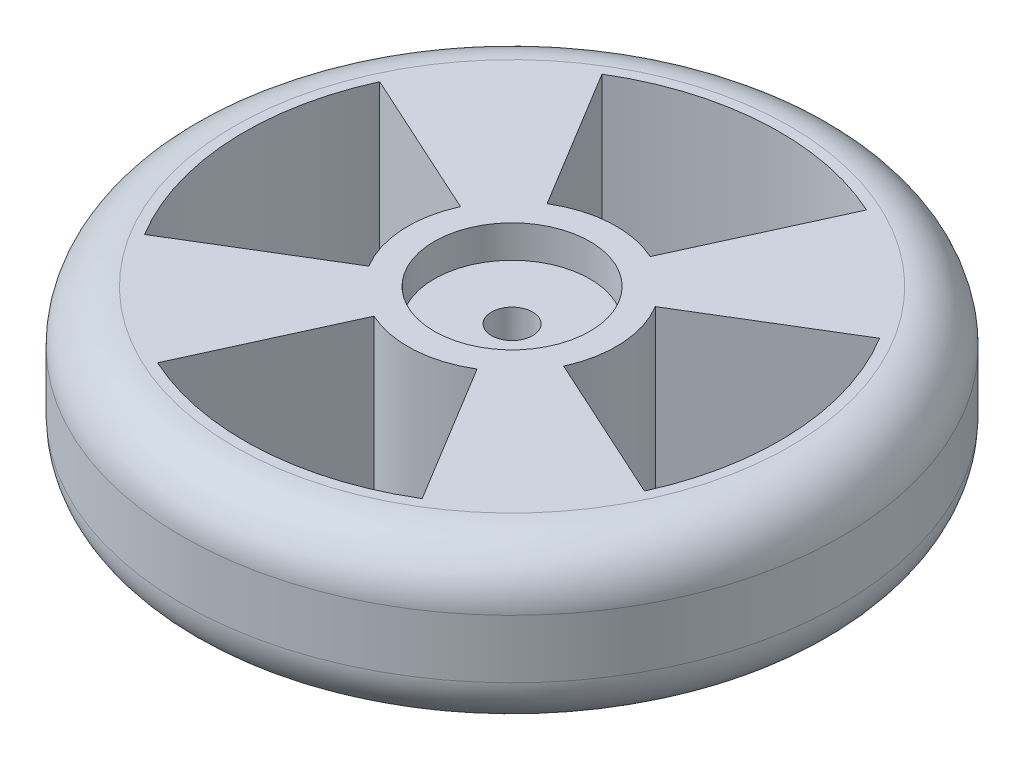
ISO-10303-21;
HEADER;
FILE_DESCRIPTION(('STEP AP214'),'2;1');
FILE_NAME('part.step','',(''),(''),'','','');
FILE_SCHEMA(('AUTOMOTIVE_DESIGN { 1 0 10303 214 1 1 1 1 }'));
ENDSEC;
DATA;
#1=APPLICATION_CONTEXT('core data for automotive mechanical design processes');
#2=APPLICATION_PROTOCOL_DEFINITION('international standard','automotive_design',2000,#1);
#3=PRODUCT_CONTEXT('',#1,'mechanical');
#4=PRODUCT('Part','Part','',(#3));
#5=PRODUCT_RELATED_PRODUCT_CATEGORY('part','',(#4));
#6=PRODUCT_DEFINITION_FORMATION('','',#4);
#7=PRODUCT_DEFINITION_CONTEXT('part definition',#1,'design');
#8=PRODUCT_DEFINITION('design','',#6,#7);
#9=PRODUCT_DEFINITION_SHAPE('','',#8);
#10=(LENGTH_UNIT() NAMED_UNIT(*) SI_UNIT(.MILLI.,.METRE.));
#11=(NAMED_UNIT(*) PLANE_ANGLE_UNIT() SI_UNIT($,.RADIAN.));
#12=(NAMED_UNIT(*) SI_UNIT($,.STERADIAN.) SOLID_ANGLE_UNIT());
#13=UNCERTAINTY_MEASURE_WITH_UNIT(LENGTH_MEASURE(1.E-05),#10,'distance_accuracy_value','');
#14=(GEOMETRIC_REPRESENTATION_CONTEXT(3) GLOBAL_UNCERTAINTY_ASSIGNED_CONTEXT((#13)) GLOBAL_UNIT_ASSIGNED_CONTEXT((#10,
#11,#12)) REPRESENTATION_CONTEXT('',''));
#15=CARTESIAN_POINT('',(0.,0.,0.));
#16=DIRECTION('',(0.,0.,1.));
#17=DIRECTION('',(1.,0.,0.));
#18=AXIS2_PLACEMENT_3D('',#15,#16,#17);
#19=CARTESIAN_POINT('',(0.,25.,0.));
#20=DIRECTION('',(0.,-1.,0.));
#21=DIRECTION('',(0.,0.,-1.));
#22=AXIS2_PLACEMENT_3D('',#19,#20,#21);
#23=CYLINDRICAL_SURFACE('',#22,50.8);
#24=CARTESIAN_POINT('',(0.,8.,0.));
#25=DIRECTION('',(0.,1.,0.));
#26=DIRECTION('',(0.,0.,1.));
#27=AXIS2_PLACEMENT_3D('',#24,#25,#26);
#28=CIRCLE('',#27,50.8);
#29=CARTESIAN_POINT('',(0.,8.,50.8));
#30=VERTEX_POINT('',#29);
#31=EDGE_CURVE('E357',#30,#30,#28,.T.);
#32=ORIENTED_EDGE('',*,*,#31,.T.);
#33=EDGE_LOOP('',(#32));
#34=FACE_BOUND('',#33,.T.);
#35=CARTESIAN_POINT('',(0.,17.,0.));
#36=DIRECTION('',(0.,1.,0.));
#37=DIRECTION('',(0.,0.,1.));
#38=AXIS2_PLACEMENT_3D('',#35,#36,#37);
#39=CIRCLE('',#38,50.8);
#40=CARTESIAN_POINT('',(0.,17.,50.8));
#41=VERTEX_POINT('',#40);
#42=EDGE_CURVE('E353',#41,#41,#39,.F.);
#43=ORIENTED_EDGE('',*,*,#42,.T.);
#44=EDGE_LOOP('',(#43));
#45=FACE_BOUND('',#44,.T.);
#46=ADVANCED_FACE('F39',(#34,#45),#23,.T.);
#47=CARTESIAN_POINT('',(0.,25.,0.));
#48=DIRECTION('',(0.,1.,0.));
#49=DIRECTION('',(0.,0.,1.));
#50=AXIS2_PLACEMENT_3D('',#47,#48,#49);
#51=PLANE('',#50);
#52=CARTESIAN_POINT('',(0.,25.,0.));
#53=DIRECTION('',(0.,-1.,0.));
#54=DIRECTION('',(0.,0.,1.));
#55=AXIS2_PLACEMENT_3D('',#52,#53,#54);
#56=CIRCLE('',#55,16.0687261905688);
#57=CARTESIAN_POINT('',(8.33744290540899,25.,13.7364845279466));
#58=VERTEX_POINT('',#57);
#59=CARTESIAN_POINT('',(-6.66964014308334,25.,14.6191607744509));
#60=VERTEX_POINT('',#59);
#61=EDGE_CURVE('E55',#58,#60,#56,.T.);
#62=ORIENTED_EDGE('',*,*,#61,.F.);
#63=DIRECTION('',(-0.518861470817922,0.,-0.854858335691162));
#64=VECTOR('',#63,1.);
#65=CARTESIAN_POINT('',(8.33744290540899,25.,13.7364845279466));
#66=LINE('',#65,#64);
#67=CARTESIAN_POINT('',(21.4007271001007,25.,35.2591028247552));
#68=VERTEX_POINT('',#67);
#69=EDGE_CURVE('E231',#68,#58,#66,.T.);
#70=ORIENTED_EDGE('',*,*,#69,.F.);
#71=CARTESIAN_POINT('',(0.,25.,0.));
#72=DIRECTION('',(0.,1.,0.));
#73=DIRECTION('',(0.,0.,1.));
#74=AXIS2_PLACEMENT_3D('',#71,#72,#73);
#75=CIRCLE('',#74,41.245550698465);
#76=CARTESIAN_POINT('',(-17.1197752329317,25.,37.5247751278211));
#77=VERTEX_POINT('',#76);
#78=EDGE_CURVE('E227',#77,#68,#75,.T.);
#79=ORIENTED_EDGE('',*,*,#78,.F.);
#80=DIRECTION('',(-0.415069624311474,0.,0.90978964984986));
#81=VECTOR('',#80,1.);
#82=CARTESIAN_POINT('',(-6.66964014308333,25.,14.6191607744509));
#83=LINE('',#82,#81);
#84=EDGE_CURVE('E223',#60,#77,#83,.T.);
#85=ORIENTED_EDGE('',*,*,#84,.F.);
#86=EDGE_LOOP('',(#62,#70,#79,#85));
#87=FACE_BOUND('',#86,.T.);
#88=CARTESIAN_POINT('',(0.,25.,0.));
#89=DIRECTION('',(0.,-1.,0.));
#90=DIRECTION('',(0.,0.,1.));
#91=AXIS2_PLACEMENT_3D('',#88,#89,#90);
#92=CIRCLE('',#91,16.0687261905688);
#93=CARTESIAN_POINT('',(13.7364845279466,25.,-8.33744290540903));
#94=VERTEX_POINT('',#93);
#95=CARTESIAN_POINT('',(14.6191607744509,25.,6.66964014308329));
#96=VERTEX_POINT('',#95);
#97=EDGE_CURVE('E63',#94,#96,#92,.T.);
#98=ORIENTED_EDGE('',*,*,#97,.F.);
#99=DIRECTION('',(-0.85485833569116,0.,0.518861470817925));
#100=VECTOR('',#99,1.);
#101=CARTESIAN_POINT('',(13.7364845279466,25.,-8.33744290540903));
#102=LINE('',#101,#100);
#103=CARTESIAN_POINT('',(35.2591028247551,25.,-21.4007271001008));
#104=VERTEX_POINT('',#103);
#105=EDGE_CURVE('E257',#104,#94,#102,.T.);
#106=ORIENTED_EDGE('',*,*,#105,.F.);
#107=CARTESIAN_POINT('',(0.,25.,0.));
#108=DIRECTION('',(0.,1.,0.));
#109=DIRECTION('',(0.,0.,1.));
#110=AXIS2_PLACEMENT_3D('',#107,#108,#109);
#111=CIRCLE('',#110,41.245550698465);
#112=CARTESIAN_POINT('',(37.5247751278212,25.,17.1197752329316));
#113=VERTEX_POINT('',#112);
#114=EDGE_CURVE('E253',#113,#104,#111,.T.);
#115=ORIENTED_EDGE('',*,*,#114,.F.);
#116=DIRECTION('',(0.909789649849862,0.,0.415069624311471));
#117=VECTOR('',#116,1.);
#118=CARTESIAN_POINT('',(14.6191607744509,25.,6.66964014308329));
#119=LINE('',#118,#117);
#120=EDGE_CURVE('E249',#96,#113,#119,.T.);
#121=ORIENTED_EDGE('',*,*,#120,.F.);
#122=EDGE_LOOP('',(#98,#106,#115,#121));
#123=FACE_BOUND('',#122,.T.);
#124=CARTESIAN_POINT('',(0.,25.,0.));
#125=DIRECTION('',(0.,-1.,0.));
#126=DIRECTION('',(0.,0.,1.));
#127=AXIS2_PLACEMENT_3D('',#124,#125,#126);
#128=CIRCLE('',#127,16.0687261905688);
#129=CARTESIAN_POINT('',(-13.7364845279467,25.,8.33744290540894));
#130=VERTEX_POINT('',#129);
#131=CARTESIAN_POINT('',(-14.6191607744508,25.,-6.66964014308339));
#132=VERTEX_POINT('',#131);
#133=EDGE_CURVE('E202',#130,#132,#128,.T.);
#134=ORIENTED_EDGE('',*,*,#133,.F.);
#135=DIRECTION('',(0.854858335691163,0.,-0.518861470817919));
#136=VECTOR('',#135,1.);
#137=CARTESIAN_POINT('',(-13.7364845279467,25.,8.33744290540894));
#138=LINE('',#137,#136);
#139=CARTESIAN_POINT('',(-35.2591028247553,25.,21.4007271001006));
#140=VERTEX_POINT('',#139);
#141=EDGE_CURVE('E207',#140,#130,#138,.T.);
#142=ORIENTED_EDGE('',*,*,#141,.F.);
#143=CARTESIAN_POINT('',(0.,25.,0.));
#144=DIRECTION('',(0.,1.,0.));
#145=DIRECTION('',(0.,0.,1.));
#146=AXIS2_PLACEMENT_3D('',#143,#144,#145);
#147=CIRCLE('',#146,41.245550698465);
#148=CARTESIAN_POINT('',(-37.5247751278211,25.,-17.1197752329319));
#149=VERTEX_POINT('',#148);
#150=EDGE_CURVE('E184',#149,#140,#147,.T.);
#151=ORIENTED_EDGE('',*,*,#150,.F.);
#152=DIRECTION('',(-0.909789649849859,0.,-0.415069624311477));
#153=VECTOR('',#152,1.);
#154=CARTESIAN_POINT('',(-14.6191607744508,25.,-6.66964014308339));
#155=LINE('',#154,#153);
#156=EDGE_CURVE('E196',#132,#149,#155,.T.);
#157=ORIENTED_EDGE('',*,*,#156,.F.);
#158=EDGE_LOOP('',(#134,#142,#151,#157));
#159=FACE_BOUND('',#158,.T.);
#160=CARTESIAN_POINT('',(0.,25.,0.));
#161=DIRECTION('',(0.,-1.,0.));
#162=DIRECTION('',(0.,0.,1.));
#163=AXIS2_PLACEMENT_3D('',#160,#161,#162);
#164=CIRCLE('',#163,16.0687261905688);
#165=CARTESIAN_POINT('',(-8.33744290540909,25.,-13.7364845279466));
#166=VERTEX_POINT('',#165);
#167=CARTESIAN_POINT('',(6.66964014308323,25.,-14.6191607744509));
#168=VERTEX_POINT('',#167);
#169=EDGE_CURVE('E265',#166,#168,#164,.T.);
#170=ORIENTED_EDGE('',*,*,#169,.F.);
#171=DIRECTION('',(0.518861470817928,0.,0.854858335691158));
#172=VECTOR('',#171,1.);
#173=CARTESIAN_POINT('',(-8.33744290540909,25.,-13.7364845279466));
#174=LINE('',#173,#172);
#175=CARTESIAN_POINT('',(-21.4007271001009,25.,-35.259102824755));
#176=VERTEX_POINT('',#175);
#177=EDGE_CURVE('E284',#176,#166,#174,.T.);
#178=ORIENTED_EDGE('',*,*,#177,.F.);
#179=CARTESIAN_POINT('',(0.,25.,0.));
#180=DIRECTION('',(0.,1.,0.));
#181=DIRECTION('',(0.,0.,1.));
#182=AXIS2_PLACEMENT_3D('',#179,#180,#181);
#183=CIRCLE('',#182,41.245550698465);
#184=CARTESIAN_POINT('',(17.1197752329315,25.,-37.5247751278212));
#185=VERTEX_POINT('',#184);
#186=EDGE_CURVE('E280',#185,#176,#183,.T.);
#187=ORIENTED_EDGE('',*,*,#186,.F.);
#188=DIRECTION('',(0.415069624311468,0.,-0.909789649849864));
#189=VECTOR('',#188,1.);
#190=CARTESIAN_POINT('',(6.66964014308324,25.,-14.6191607744509));
#191=LINE('',#190,#189);
#192=EDGE_CURVE('E276',#168,#185,#191,.T.);
#193=ORIENTED_EDGE('',*,*,#192,.F.);
#194=EDGE_LOOP('',(#170,#178,#187,#193));
#195=FACE_BOUND('',#194,.T.);
#196=CARTESIAN_POINT('',(0.,25.,0.));
#197=DIRECTION('',(0.,1.,0.));
#198=DIRECTION('',(0.,0.,1.));
#199=AXIS2_PLACEMENT_3D('',#196,#197,#198);
#200=CIRCLE('',#199,12.);
#201=CARTESIAN_POINT('',(0.,25.,12.));
#202=VERTEX_POINT('',#201);
#203=EDGE_CURVE('E342',#202,#202,#200,.T.);
#204=ORIENTED_EDGE('',*,*,#203,.F.);
#205=EDGE_LOOP('',(#204));
#206=FACE_BOUND('',#205,.T.);
#207=CARTESIAN_POINT('',(0.,25.,0.));
#208=DIRECTION('',(0.,1.,0.));
#209=DIRECTION('',(0.,0.,1.));
#210=AXIS2_PLACEMENT_3D('',#207,#208,#209);
#211=CIRCLE('',#210,42.8);
#212=CARTESIAN_POINT('',(0.,25.,42.8));
#213=VERTEX_POINT('',#212);
#214=EDGE_CURVE('E349',#213,#213,#211,.T.);
#215=ORIENTED_EDGE('',*,*,#214,.T.);
#216=EDGE_LOOP('',(#215));
#217=FACE_BOUND('',#216,.T.);
#218=ADVANCED_FACE('F204',(#87,#123,#159,#195,#206,#217),#51,.T.);
#219=CARTESIAN_POINT('',(0.,0.,0.));
#220=DIRECTION('',(0.,1.,0.));
#221=DIRECTION('',(0.,0.,1.));
#222=AXIS2_PLACEMENT_3D('',#219,#220,#221);
#223=PLANE('',#222);
#224=CARTESIAN_POINT('',(0.,0.,0.));
#225=DIRECTION('',(0.,1.,0.));
#226=DIRECTION('',(0.,0.,1.));
#227=AXIS2_PLACEMENT_3D('',#224,#225,#226);
#228=CIRCLE('',#227,41.245550698465);
#229=CARTESIAN_POINT('',(-17.1197752329317,0.,37.5247751278211));
#230=VERTEX_POINT('',#229);
#231=CARTESIAN_POINT('',(21.4007271001007,0.,35.2591028247552));
#232=VERTEX_POINT('',#231);
#233=EDGE_CURVE('E11',#230,#232,#228,.T.);
#234=ORIENTED_EDGE('',*,*,#233,.T.);
#235=DIRECTION('',(-0.518861470817922,0.,-0.854858335691162));
#236=VECTOR('',#235,1.);
#237=CARTESIAN_POINT('',(0.,0.,0.));
#238=LINE('',#237,#236);
#239=CARTESIAN_POINT('',(11.6309017171609,0.,19.1626741312013));
#240=VERTEX_POINT('',#239);
#241=EDGE_CURVE('E328',#232,#240,#238,.T.);
#242=ORIENTED_EDGE('',*,*,#241,.T.);
#243=CARTESIAN_POINT('',(0.,0.,0.));
#244=DIRECTION('',(0.,1.,0.));
#245=DIRECTION('',(0.,0.,1.));
#246=AXIS2_PLACEMENT_3D('',#243,#244,#245);
#247=CIRCLE('',#246,22.4161984870957);
#248=CARTESIAN_POINT('',(20.3940253725398,0.,9.30428308453016));
#249=VERTEX_POINT('',#248);
#250=EDGE_CURVE('E366',#240,#249,#247,.T.);
#251=ORIENTED_EDGE('',*,*,#250,.T.);
#252=DIRECTION('',(0.909789649849862,0.,0.415069624311471));
#253=VECTOR('',#252,1.);
#254=CARTESIAN_POINT('',(0.,0.,0.));
#255=LINE('',#254,#253);
#256=CARTESIAN_POINT('',(37.5247751278212,0.,17.1197752329316));
#257=VERTEX_POINT('',#256);
#258=EDGE_CURVE('E316',#249,#257,#255,.T.);
#259=ORIENTED_EDGE('',*,*,#258,.T.);
#260=CARTESIAN_POINT('',(0.,0.,0.));
#261=DIRECTION('',(0.,1.,0.));
#262=DIRECTION('',(0.,0.,1.));
#263=AXIS2_PLACEMENT_3D('',#260,#261,#262);
#264=CIRCLE('',#263,41.245550698465);
#265=CARTESIAN_POINT('',(35.2591028247551,0.,-21.4007271001008));
#266=VERTEX_POINT('',#265);
#267=EDGE_CURVE('E48',#257,#266,#264,.T.);
#268=ORIENTED_EDGE('',*,*,#267,.T.);
#269=DIRECTION('',(-0.85485833569116,0.,0.518861470817925));
#270=VECTOR('',#269,1.);
#271=CARTESIAN_POINT('',(0.,0.,0.));
#272=LINE('',#271,#270);
#273=CARTESIAN_POINT('',(19.1626741312013,0.,-11.630901717161));
#274=VERTEX_POINT('',#273);
#275=EDGE_CURVE('E320',#266,#274,#272,.T.);
#276=ORIENTED_EDGE('',*,*,#275,.T.);
#277=CARTESIAN_POINT('',(9.30428308453009,0.,-20.3940253725398));
#278=VERTEX_POINT('',#277);
#279=EDGE_CURVE('E371',#274,#278,#247,.T.);
#280=ORIENTED_EDGE('',*,*,#279,.T.);
#281=DIRECTION('',(0.415069624311468,0.,-0.909789649849863));
#282=VECTOR('',#281,1.);
#283=CARTESIAN_POINT('',(0.,0.,0.));
#284=LINE('',#283,#282);
#285=CARTESIAN_POINT('',(17.1197752329315,0.,-37.5247751278212));
#286=VERTEX_POINT('',#285);
#287=EDGE_CURVE('E292',#278,#286,#284,.T.);
#288=ORIENTED_EDGE('',*,*,#287,.T.);
#289=CARTESIAN_POINT('',(0.,0.,0.));
#290=DIRECTION('',(0.,1.,0.));
#291=DIRECTION('',(0.,0.,1.));
#292=AXIS2_PLACEMENT_3D('',#289,#290,#291);
#293=CIRCLE('',#292,41.245550698465);
#294=CARTESIAN_POINT('',(-21.4007271001009,0.,-35.259102824755));
#295=VERTEX_POINT('',#294);
#296=EDGE_CURVE('E422',#286,#295,#293,.T.);
#297=ORIENTED_EDGE('',*,*,#296,.T.);
#298=DIRECTION('',(0.518861470817928,0.,0.854858335691158));
#299=VECTOR('',#298,1.);
#300=CARTESIAN_POINT('',(0.,0.,0.));
#301=LINE('',#300,#299);
#302=CARTESIAN_POINT('',(-11.6309017171611,0.,-19.1626741312012));
#303=VERTEX_POINT('',#302);
#304=EDGE_CURVE('E305',#295,#303,#301,.T.);
#305=ORIENTED_EDGE('',*,*,#304,.T.);
#306=CARTESIAN_POINT('',(-20.3940253725397,0.,-9.3042830845303));
#307=VERTEX_POINT('',#306);
#308=EDGE_CURVE('E451',#303,#307,#247,.T.);
#309=ORIENTED_EDGE('',*,*,#308,.T.);
#310=DIRECTION('',(-0.909789649849859,0.,-0.415069624311477));
#311=VECTOR('',#310,1.);
#312=CARTESIAN_POINT('',(0.,0.,0.));
#313=LINE('',#312,#311);
#314=CARTESIAN_POINT('',(-37.5247751278211,0.,-17.1197752329319));
#315=VERTEX_POINT('',#314);
#316=EDGE_CURVE('E309',#307,#315,#313,.T.);
#317=ORIENTED_EDGE('',*,*,#316,.T.);
#318=CARTESIAN_POINT('',(0.,0.,0.));
#319=DIRECTION('',(0.,1.,0.));
#320=DIRECTION('',(0.,0.,1.));
#321=AXIS2_PLACEMENT_3D('',#318,#319,#320);
#322=CIRCLE('',#321,41.245550698465);
#323=CARTESIAN_POINT('',(-35.2591028247553,0.,21.4007271001006));
#324=VERTEX_POINT('',#323);
#325=EDGE_CURVE('E187',#315,#324,#322,.T.);
#326=ORIENTED_EDGE('',*,*,#325,.T.);
#327=DIRECTION('',(0.854858335691163,0.,-0.518861470817919));
#328=VECTOR('',#327,1.);
#329=CARTESIAN_POINT('',(0.,0.,0.));
#330=LINE('',#329,#328);
#331=CARTESIAN_POINT('',(-19.1626741312014,0.,11.6309017171609));
#332=VERTEX_POINT('',#331);
#333=EDGE_CURVE('E312',#324,#332,#330,.T.);
#334=ORIENTED_EDGE('',*,*,#333,.T.);
#335=CARTESIAN_POINT('',(-9.30428308453023,0.,20.3940253725397));
#336=VERTEX_POINT('',#335);
#337=EDGE_CURVE('E365',#332,#336,#247,.T.);
#338=ORIENTED_EDGE('',*,*,#337,.T.);
#339=DIRECTION('',(-0.415069624311474,0.,0.90978964984986));
#340=VECTOR('',#339,1.);
#341=CARTESIAN_POINT('',(0.,0.,0.));
#342=LINE('',#341,#340);
#343=EDGE_CURVE('E324',#336,#230,#342,.T.);
#344=ORIENTED_EDGE('',*,*,#343,.T.);
#345=EDGE_LOOP('',(#234,#242,#251,#259,#268,#276,#280,#288,#297,#305,#309,#317,#326,#334,#338,#344));
#346=FACE_BOUND('',#345,.T.);
#347=CARTESIAN_POINT('',(0.,0.,0.));
#348=DIRECTION('',(0.,1.,0.));
#349=DIRECTION('',(0.,0.,1.));
#350=AXIS2_PLACEMENT_3D('',#347,#348,#349);
#351=CIRCLE('',#350,42.8);
#352=CARTESIAN_POINT('',(0.,0.,42.8));
#353=VERTEX_POINT('',#352);
#354=EDGE_CURVE('E361',#353,#353,#351,.F.);
#355=ORIENTED_EDGE('',*,*,#354,.T.);
#356=EDGE_LOOP('',(#355));
#357=FACE_BOUND('',#356,.T.);
#358=ADVANCED_FACE('F430',(#346,#357),#223,.F.);
#359=CARTESIAN_POINT('',(0.,17.,0.));
#360=DIRECTION('',(0.,1.,0.));
#361=DIRECTION('',(0.,0.,1.));
#362=AXIS2_PLACEMENT_3D('',#359,#360,#361);
#363=TOROIDAL_SURFACE('',#362,42.8,8.);
#364=ORIENTED_EDGE('',*,*,#42,.F.);
#365=EDGE_LOOP('',(#364));
#366=FACE_BOUND('',#365,.T.);
#367=ORIENTED_EDGE('',*,*,#214,.F.);
#368=EDGE_LOOP('',(#367));
#369=FACE_BOUND('',#368,.T.);
#370=ADVANCED_FACE('F478',(#366,#369),#363,.T.);
#371=CARTESIAN_POINT('',(0.,8.,0.));
#372=DIRECTION('',(0.,1.,0.));
#373=DIRECTION('',(0.,0.,1.));
#374=AXIS2_PLACEMENT_3D('',#371,#372,#373);
#375=TOROIDAL_SURFACE('',#374,42.8,8.);
#376=ORIENTED_EDGE('',*,*,#354,.F.);
#377=EDGE_LOOP('',(#376));
#378=FACE_BOUND('',#377,.T.);
#379=ORIENTED_EDGE('',*,*,#31,.F.);
#380=EDGE_LOOP('',(#379));
#381=FACE_BOUND('',#380,.T.);
#382=ADVANCED_FACE('F487',(#378,#381),#375,.T.);
#383=CARTESIAN_POINT('',(0.,-5.,0.));
#384=DIRECTION('',(0.,-1.,0.));
#385=DIRECTION('',(0.,0.,-1.));
#386=AXIS2_PLACEMENT_3D('',#383,#384,#385);
#387=PLANE('',#386);
#388=CARTESIAN_POINT('',(0.,-5.,0.));
#389=DIRECTION('',(0.,-1.,0.));
#390=DIRECTION('',(0.,0.,-1.));
#391=AXIS2_PLACEMENT_3D('',#388,#389,#390);
#392=CIRCLE('',#391,3.165);
#393=CARTESIAN_POINT('',(0.,-5.,-3.165));
#394=VERTEX_POINT('',#393);
#395=EDGE_CURVE('E332',#394,#394,#392,.T.);
#396=ORIENTED_EDGE('',*,*,#395,.F.);
#397=EDGE_LOOP('',(#396));
#398=FACE_BOUND('',#397,.T.);
#399=CARTESIAN_POINT('',(0.,-5.,0.));
#400=DIRECTION('',(0.,-1.,0.));
#401=DIRECTION('',(0.,0.,-1.));
#402=AXIS2_PLACEMENT_3D('',#399,#400,#401);
#403=CIRCLE('',#402,15.);
#404=CARTESIAN_POINT('',(0.,-5.,-15.));
#405=VERTEX_POINT('',#404);
#406=EDGE_CURVE('E341',#405,#405,#403,.T.);
#407=ORIENTED_EDGE('',*,*,#406,.T.);
#408=EDGE_LOOP('',(#407));
#409=FACE_BOUND('',#408,.T.);
#410=ADVANCED_FACE('F483',(#398,#409),#387,.T.);
#411=CARTESIAN_POINT('',(0.,20.,0.));
#412=DIRECTION('',(0.,1.,0.));
#413=DIRECTION('',(0.,0.,1.));
#414=AXIS2_PLACEMENT_3D('',#411,#412,#413);
#415=CYLINDRICAL_SURFACE('',#414,12.);
#416=CARTESIAN_POINT('',(0.,20.,0.));
#417=DIRECTION('',(0.,1.,0.));
#418=DIRECTION('',(0.,0.,1.));
#419=AXIS2_PLACEMENT_3D('',#416,#417,#418);
#420=CIRCLE('',#419,12.);
#421=CARTESIAN_POINT('',(0.,20.,12.));
#422=VERTEX_POINT('',#421);
#423=EDGE_CURVE('E337',#422,#422,#420,.T.);
#424=ORIENTED_EDGE('',*,*,#423,.F.);
#425=EDGE_LOOP('',(#424));
#426=FACE_BOUND('',#425,.T.);
#427=ORIENTED_EDGE('',*,*,#203,.T.);
#428=EDGE_LOOP('',(#427));
#429=FACE_BOUND('',#428,.T.);
#430=ADVANCED_FACE('F494',(#426,#429),#415,.F.);
#431=CARTESIAN_POINT('',(0.,20.,0.));
#432=DIRECTION('',(0.,1.,0.));
#433=DIRECTION('',(0.,0.,1.));
#434=AXIS2_PLACEMENT_3D('',#431,#432,#433);
#435=PLANE('',#434);
#436=CARTESIAN_POINT('',(0.,20.,0.));
#437=DIRECTION('',(0.,1.,0.));
#438=DIRECTION('',(0.,0.,1.));
#439=AXIS2_PLACEMENT_3D('',#436,#437,#438);
#440=CIRCLE('',#439,3.165);
#441=CARTESIAN_POINT('',(0.,20.,3.165));
#442=VERTEX_POINT('',#441);
#443=EDGE_CURVE('E336',#442,#442,#440,.T.);
#444=ORIENTED_EDGE('',*,*,#443,.F.);
#445=EDGE_LOOP('',(#444));
#446=FACE_BOUND('',#445,.T.);
#447=ORIENTED_EDGE('',*,*,#423,.T.);
#448=EDGE_LOOP('',(#447));
#449=FACE_BOUND('',#448,.T.);
#450=ADVANCED_FACE('F507',(#446,#449),#435,.T.);
#451=CARTESIAN_POINT('',(0.,-8.,0.));
#452=DIRECTION('',(0.,1.,0.));
#453=DIRECTION('',(0.,0.,1.));
#454=AXIS2_PLACEMENT_3D('',#451,#452,#453);
#455=TOROIDAL_SURFACE('',#454,22.4161984870957,8.);
#456=ORIENTED_EDGE('',*,*,#250,.F.);
#457=CARTESIAN_POINT('',(11.6309017171609,-8.,19.1626741312013));
#458=DIRECTION('',(0.854858335691162,0.,-0.518861470817922));
#459=DIRECTION('',(-0.518861470817922,0.,-0.854858335691162));
#460=AXIS2_PLACEMENT_3D('',#457,#458,#459);
#461=CIRCLE('',#460,8.);
#462=CARTESIAN_POINT('',(8.33744290540899,-3.13075001208359,13.7364845279466));
#463=VERTEX_POINT('',#462);
#464=EDGE_CURVE('E418',#240,#463,#461,.F.);
#465=ORIENTED_EDGE('',*,*,#464,.T.);
#466=CARTESIAN_POINT('',(0.,-3.13075001208359,0.));
#467=DIRECTION('',(0.,-1.,0.));
#468=DIRECTION('',(0.,0.,-1.));
#469=AXIS2_PLACEMENT_3D('',#466,#467,#468);
#470=CIRCLE('',#469,16.0687261905688);
#471=CARTESIAN_POINT('',(-6.66964014308334,-3.13075001208359,14.6191607744509));
#472=VERTEX_POINT('',#471);
#473=EDGE_CURVE('E414',#463,#472,#470,.T.);
#474=ORIENTED_EDGE('',*,*,#473,.T.);
#475=CARTESIAN_POINT('',(-9.30428308453023,-8.,20.3940253725397));
#476=DIRECTION('',(-0.90978964984986,0.,-0.415069624311474));
#477=DIRECTION('',(-0.415069624311474,0.,0.90978964984986));
#478=AXIS2_PLACEMENT_3D('',#475,#476,#477);
#479=CIRCLE('',#478,8.);
#480=EDGE_CURVE('E410',#472,#336,#479,.F.);
#481=ORIENTED_EDGE('',*,*,#480,.T.);
#482=ORIENTED_EDGE('',*,*,#337,.F.);
#483=CARTESIAN_POINT('',(-19.1626741312014,-8.,11.6309017171609));
#484=DIRECTION('',(0.518861470817919,0.,0.854858335691163));
#485=DIRECTION('',(0.854858335691163,0.,-0.518861470817919));
#486=AXIS2_PLACEMENT_3D('',#483,#484,#485);
#487=CIRCLE('',#486,8.);
#488=CARTESIAN_POINT('',(-13.7364845279466,-3.13075001208359,8.33744290540894));
#489=VERTEX_POINT('',#488);
#490=EDGE_CURVE('E394',#332,#489,#487,.F.);
#491=ORIENTED_EDGE('',*,*,#490,.T.);
#492=CARTESIAN_POINT('',(0.,-3.13075001208359,0.));
#493=DIRECTION('',(0.,-1.,0.));
#494=DIRECTION('',(0.,0.,-1.));
#495=AXIS2_PLACEMENT_3D('',#492,#493,#494);
#496=CIRCLE('',#495,16.0687261905688);
#497=CARTESIAN_POINT('',(-14.6191607744508,-3.13075001208359,-6.66964014308339));
#498=VERTEX_POINT('',#497);
#499=EDGE_CURVE('E390',#489,#498,#496,.T.);
#500=ORIENTED_EDGE('',*,*,#499,.T.);
#501=CARTESIAN_POINT('',(-20.3940253725397,-8.,-9.3042830845303));
#502=DIRECTION('',(0.415069624311477,0.,-0.909789649849859));
#503=DIRECTION('',(-0.909789649849859,0.,-0.415069624311477));
#504=AXIS2_PLACEMENT_3D('',#501,#502,#503);
#505=CIRCLE('',#504,8.);
#506=EDGE_CURVE('E386',#498,#307,#505,.F.);
#507=ORIENTED_EDGE('',*,*,#506,.T.);
#508=ORIENTED_EDGE('',*,*,#308,.F.);
#509=CARTESIAN_POINT('',(-11.6309017171611,-8.,-19.1626741312012));
#510=DIRECTION('',(-0.854858335691158,0.,0.518861470817928));
#511=DIRECTION('',(0.518861470817928,0.,0.854858335691158));
#512=AXIS2_PLACEMENT_3D('',#509,#510,#511);
#513=CIRCLE('',#512,8.);
#514=CARTESIAN_POINT('',(-8.33744290540909,-3.13075001208359,-13.7364845279466));
#515=VERTEX_POINT('',#514);
#516=EDGE_CURVE('E382',#303,#515,#513,.F.);
#517=ORIENTED_EDGE('',*,*,#516,.T.);
#518=CARTESIAN_POINT('',(0.,-3.13075001208359,0.));
#519=DIRECTION('',(0.,-1.,0.));
#520=DIRECTION('',(0.,0.,-1.));
#521=AXIS2_PLACEMENT_3D('',#518,#519,#520);
#522=CIRCLE('',#521,16.0687261905688);
#523=CARTESIAN_POINT('',(6.66964014308323,-3.13075001208359,-14.6191607744509));
#524=VERTEX_POINT('',#523);
#525=EDGE_CURVE('E378',#515,#524,#522,.T.);
#526=ORIENTED_EDGE('',*,*,#525,.T.);
#527=CARTESIAN_POINT('',(9.30428308453009,-8.,-20.3940253725398));
#528=DIRECTION('',(0.909789649849863,0.,0.415069624311468));
#529=DIRECTION('',(0.415069624311468,0.,-0.909789649849863));
#530=AXIS2_PLACEMENT_3D('',#527,#528,#529);
#531=CIRCLE('',#530,8.);
#532=EDGE_CURVE('E370',#524,#278,#531,.F.);
#533=ORIENTED_EDGE('',*,*,#532,.T.);
#534=ORIENTED_EDGE('',*,*,#279,.F.);
#535=CARTESIAN_POINT('',(19.1626741312013,-8.,-11.630901717161));
#536=DIRECTION('',(-0.518861470817925,0.,-0.85485833569116));
#537=DIRECTION('',(-0.85485833569116,0.,0.518861470817925));
#538=AXIS2_PLACEMENT_3D('',#535,#536,#537);
#539=CIRCLE('',#538,8.);
#540=CARTESIAN_POINT('',(13.7364845279466,-3.13075001208359,-8.33744290540904));
#541=VERTEX_POINT('',#540);
#542=EDGE_CURVE('E406',#274,#541,#539,.F.);
#543=ORIENTED_EDGE('',*,*,#542,.T.);
#544=CARTESIAN_POINT('',(0.,-3.13075001208359,0.));
#545=DIRECTION('',(0.,-1.,0.));
#546=DIRECTION('',(0.,0.,-1.));
#547=AXIS2_PLACEMENT_3D('',#544,#545,#546);
#548=CIRCLE('',#547,16.0687261905688);
#549=CARTESIAN_POINT('',(14.6191607744509,-3.13075001208359,6.66964014308328));
#550=VERTEX_POINT('',#549);
#551=EDGE_CURVE('E402',#541,#550,#548,.T.);
#552=ORIENTED_EDGE('',*,*,#551,.T.);
#553=CARTESIAN_POINT('',(20.3940253725398,-8.,9.30428308453016));
#554=DIRECTION('',(-0.415069624311471,0.,0.909789649849862));
#555=DIRECTION('',(0.909789649849862,0.,0.415069624311471));
#556=AXIS2_PLACEMENT_3D('',#553,#554,#555);
#557=CIRCLE('',#556,8.);
#558=EDGE_CURVE('E398',#550,#249,#557,.F.);
#559=ORIENTED_EDGE('',*,*,#558,.T.);
#560=EDGE_LOOP('',(#456,#465,#474,#481,#482,#491,#500,#507,#508,#517,#526,#533,#534,#543,#552,#559));
#561=FACE_BOUND('',#560,.T.);
#562=ORIENTED_EDGE('',*,*,#406,.F.);
#563=EDGE_LOOP('',(#562));
#564=FACE_BOUND('',#563,.T.);
#565=ADVANCED_FACE('F41',(#561,#564),#455,.F.);
#566=CARTESIAN_POINT('',(0.,25.,0.));
#567=DIRECTION('',(0.,-1.,0.));
#568=DIRECTION('',(0.,0.,-1.));
#569=AXIS2_PLACEMENT_3D('',#566,#567,#568);
#570=CYLINDRICAL_SURFACE('',#569,3.165);
#571=ORIENTED_EDGE('',*,*,#443,.T.);
#572=EDGE_LOOP('',(#571));
#573=FACE_BOUND('',#572,.T.);
#574=ORIENTED_EDGE('',*,*,#395,.T.);
#575=EDGE_LOOP('',(#574));
#576=FACE_BOUND('',#575,.T.);
#577=ADVANCED_FACE('F513',(#573,#576),#570,.F.);
#578=CARTESIAN_POINT('',(0.,-5.,0.));
#579=DIRECTION('',(0.,1.,0.));
#580=DIRECTION('',(0.,0.,1.));
#581=AXIS2_PLACEMENT_3D('',#578,#579,#580);
#582=CYLINDRICAL_SURFACE('',#581,41.245550698465);
#583=DIRECTION('',(0.,1.,0.));
#584=VECTOR('',#583,1.);
#585=CARTESIAN_POINT('',(17.1197752329315,-5.,-37.5247751278212));
#586=LINE('',#585,#584);
#587=EDGE_CURVE('E296',#286,#185,#586,.T.);
#588=ORIENTED_EDGE('',*,*,#587,.T.);
#589=ORIENTED_EDGE('',*,*,#186,.T.);
#590=DIRECTION('',(0.,1.,0.));
#591=VECTOR('',#590,1.);
#592=CARTESIAN_POINT('',(-21.4007271001009,-5.,-35.259102824755));
#593=LINE('',#592,#591);
#594=EDGE_CURVE('E293',#295,#176,#593,.T.);
#595=ORIENTED_EDGE('',*,*,#594,.F.);
#596=ORIENTED_EDGE('',*,*,#296,.F.);
#597=EDGE_LOOP('',(#588,#589,#595,#596));
#598=FACE_BOUND('',#597,.T.);
#599=ADVANCED_FACE('F518',(#598),#582,.F.);
#600=CARTESIAN_POINT('',(0.,-5.,0.));
#601=DIRECTION('',(0.,1.,0.));
#602=DIRECTION('',(0.,0.,1.));
#603=AXIS2_PLACEMENT_3D('',#600,#601,#602);
#604=CYLINDRICAL_SURFACE('',#603,16.0687261905688);
#605=DIRECTION('',(0.,1.,0.));
#606=VECTOR('',#605,1.);
#607=CARTESIAN_POINT('',(-8.33744290540909,-5.,-13.7364845279466));
#608=LINE('',#607,#606);
#609=EDGE_CURVE('E289',#515,#166,#608,.T.);
#610=ORIENTED_EDGE('',*,*,#609,.T.);
#611=ORIENTED_EDGE('',*,*,#169,.T.);
#612=DIRECTION('',(0.,1.,0.));
#613=VECTOR('',#612,1.);
#614=CARTESIAN_POINT('',(6.66964014308324,-5.,-14.6191607744509));
#615=LINE('',#614,#613);
#616=EDGE_CURVE('E288',#524,#168,#615,.T.);
#617=ORIENTED_EDGE('',*,*,#616,.F.);
#618=ORIENTED_EDGE('',*,*,#525,.F.);
#619=EDGE_LOOP('',(#610,#611,#617,#618));
#620=FACE_BOUND('',#619,.T.);
#621=ADVANCED_FACE('F528',(#620),#604,.T.);
#622=CARTESIAN_POINT('',(-8.33744290540909,-5.,-13.7364845279466));
#623=DIRECTION('',(-0.854858335691158,0.,0.518861470817928));
#624=DIRECTION('',(0.518861470817928,0.,0.854858335691158));
#625=AXIS2_PLACEMENT_3D('',#622,#623,#624);
#626=PLANE('',#625);
#627=ORIENTED_EDGE('',*,*,#594,.T.);
#628=ORIENTED_EDGE('',*,*,#177,.T.);
#629=ORIENTED_EDGE('',*,*,#609,.F.);
#630=ORIENTED_EDGE('',*,*,#516,.F.);
#631=ORIENTED_EDGE('',*,*,#304,.F.);
#632=EDGE_LOOP('',(#627,#628,#629,#630,#631));
#633=FACE_BOUND('',#632,.T.);
#634=ADVANCED_FACE('F531',(#633),#626,.F.);
#635=CARTESIAN_POINT('',(6.66964014308324,-5.,-14.6191607744509));
#636=DIRECTION('',(0.909789649849863,0.,0.415069624311468));
#637=DIRECTION('',(0.415069624311468,0.,-0.909789649849863));
#638=AXIS2_PLACEMENT_3D('',#635,#636,#637);
#639=PLANE('',#638);
#640=ORIENTED_EDGE('',*,*,#532,.F.);
#641=ORIENTED_EDGE('',*,*,#616,.T.);
#642=ORIENTED_EDGE('',*,*,#192,.T.);
#643=ORIENTED_EDGE('',*,*,#587,.F.);
#644=ORIENTED_EDGE('',*,*,#287,.F.);
#645=EDGE_LOOP('',(#640,#641,#642,#643,#644));
#646=FACE_BOUND('',#645,.T.);
#647=ADVANCED_FACE('F533',(#646),#639,.F.);
#648=CARTESIAN_POINT('',(0.,-5.,0.));
#649=DIRECTION('',(0.,1.,0.));
#650=DIRECTION('',(0.,0.,1.));
#651=AXIS2_PLACEMENT_3D('',#648,#649,#650);
#652=CYLINDRICAL_SURFACE('',#651,41.245550698465);
#653=DIRECTION('',(0.,1.,0.));
#654=VECTOR('',#653,1.);
#655=CARTESIAN_POINT('',(-37.5247751278211,-5.,-17.1197752329319));
#656=LINE('',#655,#654);
#657=EDGE_CURVE('E179',#315,#149,#656,.T.);
#658=ORIENTED_EDGE('',*,*,#657,.T.);
#659=ORIENTED_EDGE('',*,*,#150,.T.);
#660=DIRECTION('',(0.,1.,0.));
#661=VECTOR('',#660,1.);
#662=CARTESIAN_POINT('',(-35.2591028247553,-5.,21.4007271001006));
#663=LINE('',#662,#661);
#664=EDGE_CURVE('E191',#324,#140,#663,.T.);
#665=ORIENTED_EDGE('',*,*,#664,.F.);
#666=ORIENTED_EDGE('',*,*,#325,.F.);
#667=EDGE_LOOP('',(#658,#659,#665,#666));
#668=FACE_BOUND('',#667,.T.);
#669=ADVANCED_FACE('F181',(#668),#652,.F.);
#670=CARTESIAN_POINT('',(0.,-5.,0.));
#671=DIRECTION('',(0.,1.,0.));
#672=DIRECTION('',(0.,0.,1.));
#673=AXIS2_PLACEMENT_3D('',#670,#671,#672);
#674=CYLINDRICAL_SURFACE('',#673,16.0687261905688);
#675=DIRECTION('',(0.,1.,0.));
#676=VECTOR('',#675,1.);
#677=CARTESIAN_POINT('',(-13.7364845279467,-5.,8.33744290540894));
#678=LINE('',#677,#676);
#679=EDGE_CURVE('E214',#489,#130,#678,.T.);
#680=ORIENTED_EDGE('',*,*,#679,.T.);
#681=ORIENTED_EDGE('',*,*,#133,.T.);
#682=DIRECTION('',(0.,1.,0.));
#683=VECTOR('',#682,1.);
#684=CARTESIAN_POINT('',(-14.6191607744508,-5.,-6.66964014308339));
#685=LINE('',#684,#683);
#686=EDGE_CURVE('E192',#498,#132,#685,.T.);
#687=ORIENTED_EDGE('',*,*,#686,.F.);
#688=ORIENTED_EDGE('',*,*,#499,.F.);
#689=EDGE_LOOP('',(#680,#681,#687,#688));
#690=FACE_BOUND('',#689,.T.);
#691=ADVANCED_FACE('F560',(#690),#674,.T.);
#692=CARTESIAN_POINT('',(-13.7364845279467,-5.,8.33744290540894));
#693=DIRECTION('',(0.518861470817919,0.,0.854858335691163));
#694=DIRECTION('',(0.854858335691163,0.,-0.518861470817919));
#695=AXIS2_PLACEMENT_3D('',#692,#693,#694);
#696=PLANE('',#695);
#697=ORIENTED_EDGE('',*,*,#664,.T.);
#698=ORIENTED_EDGE('',*,*,#141,.T.);
#699=ORIENTED_EDGE('',*,*,#679,.F.);
#700=ORIENTED_EDGE('',*,*,#490,.F.);
#701=ORIENTED_EDGE('',*,*,#333,.F.);
#702=EDGE_LOOP('',(#697,#698,#699,#700,#701));
#703=FACE_BOUND('',#702,.T.);
#704=ADVANCED_FACE('F563',(#703),#696,.F.);
#705=CARTESIAN_POINT('',(-14.6191607744508,-5.,-6.66964014308339));
#706=DIRECTION('',(0.415069624311477,0.,-0.909789649849859));
#707=DIRECTION('',(-0.909789649849859,0.,-0.415069624311477));
#708=AXIS2_PLACEMENT_3D('',#705,#706,#707);
#709=PLANE('',#708);
#710=ORIENTED_EDGE('',*,*,#506,.F.);
#711=ORIENTED_EDGE('',*,*,#686,.T.);
#712=ORIENTED_EDGE('',*,*,#156,.T.);
#713=ORIENTED_EDGE('',*,*,#657,.F.);
#714=ORIENTED_EDGE('',*,*,#316,.F.);
#715=EDGE_LOOP('',(#710,#711,#712,#713,#714));
#716=FACE_BOUND('',#715,.T.);
#717=ADVANCED_FACE('F197',(#716),#709,.F.);
#718=CARTESIAN_POINT('',(0.,-5.,0.));
#719=DIRECTION('',(0.,1.,0.));
#720=DIRECTION('',(0.,0.,1.));
#721=AXIS2_PLACEMENT_3D('',#718,#719,#720);
#722=CYLINDRICAL_SURFACE('',#721,41.245550698465);
#723=DIRECTION('',(0.,1.,0.));
#724=VECTOR('',#723,1.);
#725=CARTESIAN_POINT('',(37.5247751278212,-5.,17.1197752329316));
#726=LINE('',#725,#724);
#727=EDGE_CURVE('E269',#257,#113,#726,.T.);
#728=ORIENTED_EDGE('',*,*,#727,.T.);
#729=ORIENTED_EDGE('',*,*,#114,.T.);
#730=DIRECTION('',(0.,1.,0.));
#731=VECTOR('',#730,1.);
#732=CARTESIAN_POINT('',(35.2591028247551,-5.,-21.4007271001008));
#733=LINE('',#732,#731);
#734=EDGE_CURVE('E266',#266,#104,#733,.T.);
#735=ORIENTED_EDGE('',*,*,#734,.F.);
#736=ORIENTED_EDGE('',*,*,#267,.F.);
#737=EDGE_LOOP('',(#728,#729,#735,#736));
#738=FACE_BOUND('',#737,.T.);
#739=ADVANCED_FACE('F437',(#738),#722,.F.);
#740=CARTESIAN_POINT('',(0.,-5.,0.));
#741=DIRECTION('',(0.,1.,0.));
#742=DIRECTION('',(0.,0.,1.));
#743=AXIS2_PLACEMENT_3D('',#740,#741,#742);
#744=CYLINDRICAL_SURFACE('',#743,16.0687261905688);
#745=DIRECTION('',(0.,1.,0.));
#746=VECTOR('',#745,1.);
#747=CARTESIAN_POINT('',(13.7364845279466,-5.,-8.33744290540903));
#748=LINE('',#747,#746);
#749=EDGE_CURVE('E262',#541,#94,#748,.T.);
#750=ORIENTED_EDGE('',*,*,#749,.T.);
#751=ORIENTED_EDGE('',*,*,#97,.T.);
#752=DIRECTION('',(0.,1.,0.));
#753=VECTOR('',#752,1.);
#754=CARTESIAN_POINT('',(14.6191607744509,-5.,6.66964014308329));
#755=LINE('',#754,#753);
#756=EDGE_CURVE('E261',#550,#96,#755,.T.);
#757=ORIENTED_EDGE('',*,*,#756,.F.);
#758=ORIENTED_EDGE('',*,*,#551,.F.);
#759=EDGE_LOOP('',(#750,#751,#757,#758));
#760=FACE_BOUND('',#759,.T.);
#761=ADVANCED_FACE('F543',(#760),#744,.T.);
#762=CARTESIAN_POINT('',(13.7364845279466,-5.,-8.33744290540903));
#763=DIRECTION('',(-0.518861470817925,0.,-0.85485833569116));
#764=DIRECTION('',(-0.85485833569116,0.,0.518861470817925));
#765=AXIS2_PLACEMENT_3D('',#762,#763,#764);
#766=PLANE('',#765);
#767=ORIENTED_EDGE('',*,*,#734,.T.);
#768=ORIENTED_EDGE('',*,*,#105,.T.);
#769=ORIENTED_EDGE('',*,*,#749,.F.);
#770=ORIENTED_EDGE('',*,*,#542,.F.);
#771=ORIENTED_EDGE('',*,*,#275,.F.);
#772=EDGE_LOOP('',(#767,#768,#769,#770,#771));
#773=FACE_BOUND('',#772,.T.);
#774=ADVANCED_FACE('F446',(#773),#766,.F.);
#775=CARTESIAN_POINT('',(14.6191607744509,-5.,6.66964014308329));
#776=DIRECTION('',(-0.415069624311471,0.,0.909789649849862));
#777=DIRECTION('',(0.909789649849862,0.,0.415069624311471));
#778=AXIS2_PLACEMENT_3D('',#775,#776,#777);
#779=PLANE('',#778);
#780=ORIENTED_EDGE('',*,*,#558,.F.);
#781=ORIENTED_EDGE('',*,*,#756,.T.);
#782=ORIENTED_EDGE('',*,*,#120,.T.);
#783=ORIENTED_EDGE('',*,*,#727,.F.);
#784=ORIENTED_EDGE('',*,*,#258,.F.);
#785=EDGE_LOOP('',(#780,#781,#782,#783,#784));
#786=FACE_BOUND('',#785,.T.);
#787=ADVANCED_FACE('F439',(#786),#779,.F.);
#788=CARTESIAN_POINT('',(0.,-5.,0.));
#789=DIRECTION('',(0.,1.,0.));
#790=DIRECTION('',(0.,0.,1.));
#791=AXIS2_PLACEMENT_3D('',#788,#789,#790);
#792=CYLINDRICAL_SURFACE('',#791,41.245550698465);
#793=DIRECTION('',(0.,1.,0.));
#794=VECTOR('',#793,1.);
#795=CARTESIAN_POINT('',(-17.1197752329317,-5.,37.5247751278211));
#796=LINE('',#795,#794);
#797=EDGE_CURVE('E242',#230,#77,#796,.T.);
#798=ORIENTED_EDGE('',*,*,#797,.T.);
#799=ORIENTED_EDGE('',*,*,#78,.T.);
#800=DIRECTION('',(0.,1.,0.));
#801=VECTOR('',#800,1.);
#802=CARTESIAN_POINT('',(21.4007271001007,-5.,35.2591028247552));
#803=LINE('',#802,#801);
#804=EDGE_CURVE('E239',#232,#68,#803,.T.);
#805=ORIENTED_EDGE('',*,*,#804,.F.);
#806=ORIENTED_EDGE('',*,*,#233,.F.);
#807=EDGE_LOOP('',(#798,#799,#805,#806));
#808=FACE_BOUND('',#807,.T.);
#809=ADVANCED_FACE('F469',(#808),#792,.F.);
#810=CARTESIAN_POINT('',(0.,-5.,0.));
#811=DIRECTION('',(0.,1.,0.));
#812=DIRECTION('',(0.,0.,1.));
#813=AXIS2_PLACEMENT_3D('',#810,#811,#812);
#814=CYLINDRICAL_SURFACE('',#813,16.0687261905688);
#815=DIRECTION('',(0.,1.,0.));
#816=VECTOR('',#815,1.);
#817=CARTESIAN_POINT('',(8.33744290540899,-5.,13.7364845279466));
#818=LINE('',#817,#816);
#819=EDGE_CURVE('E236',#463,#58,#818,.T.);
#820=ORIENTED_EDGE('',*,*,#819,.T.);
#821=ORIENTED_EDGE('',*,*,#61,.T.);
#822=DIRECTION('',(0.,1.,0.));
#823=VECTOR('',#822,1.);
#824=CARTESIAN_POINT('',(-6.66964014308333,-5.,14.6191607744509));
#825=LINE('',#824,#823);
#826=EDGE_CURVE('E235',#472,#60,#825,.T.);
#827=ORIENTED_EDGE('',*,*,#826,.F.);
#828=ORIENTED_EDGE('',*,*,#473,.F.);
#829=EDGE_LOOP('',(#820,#821,#827,#828));
#830=FACE_BOUND('',#829,.T.);
#831=ADVANCED_FACE('F462',(#830),#814,.T.);
#832=CARTESIAN_POINT('',(8.33744290540899,-5.,13.7364845279466));
#833=DIRECTION('',(0.854858335691162,0.,-0.518861470817922));
#834=DIRECTION('',(-0.518861470817922,0.,-0.854858335691162));
#835=AXIS2_PLACEMENT_3D('',#832,#833,#834);
#836=PLANE('',#835);
#837=ORIENTED_EDGE('',*,*,#804,.T.);
#838=ORIENTED_EDGE('',*,*,#69,.T.);
#839=ORIENTED_EDGE('',*,*,#819,.F.);
#840=ORIENTED_EDGE('',*,*,#464,.F.);
#841=ORIENTED_EDGE('',*,*,#241,.F.);
#842=EDGE_LOOP('',(#837,#838,#839,#840,#841));
#843=FACE_BOUND('',#842,.T.);
#844=ADVANCED_FACE('F465',(#843),#836,.F.);
#845=CARTESIAN_POINT('',(-6.66964014308333,-5.,14.6191607744509));
#846=DIRECTION('',(-0.90978964984986,0.,-0.415069624311474));
#847=DIRECTION('',(-0.415069624311474,0.,0.90978964984986));
#848=AXIS2_PLACEMENT_3D('',#845,#846,#847);
#849=PLANE('',#848);
#850=ORIENTED_EDGE('',*,*,#480,.F.);
#851=ORIENTED_EDGE('',*,*,#826,.T.);
#852=ORIENTED_EDGE('',*,*,#84,.T.);
#853=ORIENTED_EDGE('',*,*,#797,.F.);
#854=ORIENTED_EDGE('',*,*,#343,.F.);
#855=EDGE_LOOP('',(#850,#851,#852,#853,#854));
#856=FACE_BOUND('',#855,.T.);
#857=ADVANCED_FACE('F459',(#856),#849,.F.);
#858=CLOSED_SHELL('',(#46,#218,#358,#370,#382,#410,#430,#450,#565,#577,#599,#621,#634,#647,#669,
#691,#704,#717,#739,#761,#774,#787,#809,#831,#844,#857));
#859=MANIFOLD_SOLID_BREP('B2',#858);
#860=ADVANCED_BREP_SHAPE_REPRESENTATION('',(#18,#859),#14);
#861=SHAPE_DEFINITION_REPRESENTATION(#9,#860);
ENDSEC;
END-ISO-10303-21;
